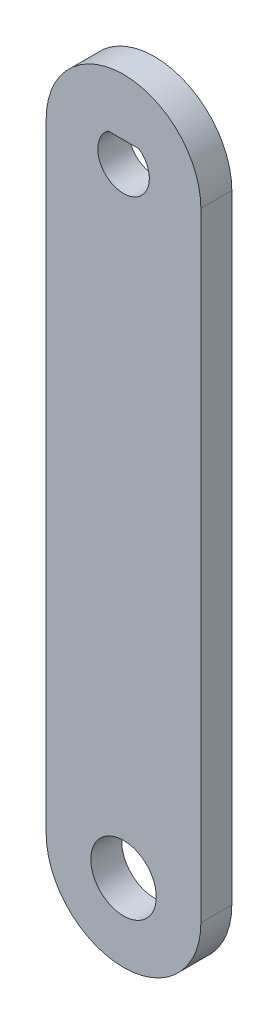
ISO-10303-21;
HEADER;
FILE_DESCRIPTION(('STEP AP214'),'2;1');
FILE_NAME('part.step','',(''),(''),'','','');
FILE_SCHEMA(('AUTOMOTIVE_DESIGN { 1 0 10303 214 1 1 1 1 }'));
ENDSEC;
DATA;
#1=APPLICATION_CONTEXT('core data for automotive mechanical design processes');
#2=APPLICATION_PROTOCOL_DEFINITION('international standard','automotive_design',2000,#1);
#3=PRODUCT_CONTEXT('',#1,'mechanical');
#4=PRODUCT('Part','Part','',(#3));
#5=PRODUCT_RELATED_PRODUCT_CATEGORY('part','',(#4));
#6=PRODUCT_DEFINITION_FORMATION('','',#4);
#7=PRODUCT_DEFINITION_CONTEXT('part definition',#1,'design');
#8=PRODUCT_DEFINITION('design','',#6,#7);
#9=PRODUCT_DEFINITION_SHAPE('','',#8);
#10=(LENGTH_UNIT() NAMED_UNIT(*) SI_UNIT(.MILLI.,.METRE.));
#11=(NAMED_UNIT(*) PLANE_ANGLE_UNIT() SI_UNIT($,.RADIAN.));
#12=(NAMED_UNIT(*) SI_UNIT($,.STERADIAN.) SOLID_ANGLE_UNIT());
#13=UNCERTAINTY_MEASURE_WITH_UNIT(LENGTH_MEASURE(1.E-05),#10,'distance_accuracy_value','');
#14=(GEOMETRIC_REPRESENTATION_CONTEXT(3) GLOBAL_UNCERTAINTY_ASSIGNED_CONTEXT((#13)) GLOBAL_UNIT_ASSIGNED_CONTEXT((#10,
#11,#12)) REPRESENTATION_CONTEXT('',''));
#15=CARTESIAN_POINT('',(0.,0.,0.));
#16=DIRECTION('',(0.,0.,1.));
#17=DIRECTION('',(1.,0.,0.));
#18=AXIS2_PLACEMENT_3D('',#15,#16,#17);
#19=CARTESIAN_POINT('',(0.,0.,-1.5));
#20=DIRECTION('',(0.,0.,1.));
#21=DIRECTION('',(1.,0.,0.));
#22=AXIS2_PLACEMENT_3D('',#19,#20,#21);
#23=CYLINDRICAL_SURFACE('',#22,7.5);
#24=DIRECTION('',(0.,0.,1.));
#25=VECTOR('',#24,1.);
#26=CARTESIAN_POINT('',(-7.5,0.,-1.5));
#27=LINE('',#26,#25);
#28=CARTESIAN_POINT('',(-7.5,0.,-1.5));
#29=VERTEX_POINT('',#28);
#30=CARTESIAN_POINT('',(-7.5,0.,1.5));
#31=VERTEX_POINT('',#30);
#32=EDGE_CURVE('E39',#29,#31,#27,.T.);
#33=ORIENTED_EDGE('',*,*,#32,.T.);
#34=CARTESIAN_POINT('',(0.,0.,1.5));
#35=DIRECTION('',(0.,0.,1.));
#36=DIRECTION('',(1.,0.,0.));
#37=AXIS2_PLACEMENT_3D('',#34,#35,#36);
#38=CIRCLE('',#37,7.5);
#39=CARTESIAN_POINT('',(7.5,0.,1.5));
#40=VERTEX_POINT('',#39);
#41=EDGE_CURVE('E102',#40,#31,#38,.T.);
#42=ORIENTED_EDGE('',*,*,#41,.F.);
#43=DIRECTION('',(0.,0.,1.));
#44=VECTOR('',#43,1.);
#45=CARTESIAN_POINT('',(7.5,0.,-1.5));
#46=LINE('',#45,#44);
#47=CARTESIAN_POINT('',(7.5,0.,-1.5));
#48=VERTEX_POINT('',#47);
#49=EDGE_CURVE('E11',#48,#40,#46,.T.);
#50=ORIENTED_EDGE('',*,*,#49,.F.);
#51=CARTESIAN_POINT('',(0.,0.,-1.5));
#52=DIRECTION('',(0.,0.,1.));
#53=DIRECTION('',(1.,0.,0.));
#54=AXIS2_PLACEMENT_3D('',#51,#52,#53);
#55=CIRCLE('',#54,7.5);
#56=EDGE_CURVE('E96',#48,#29,#55,.T.);
#57=ORIENTED_EDGE('',*,*,#56,.T.);
#58=EDGE_LOOP('',(#33,#42,#50,#57));
#59=FACE_BOUND('',#58,.T.);
#60=ADVANCED_FACE('F36',(#59),#23,.T.);
#61=CARTESIAN_POINT('',(7.5,0.,-1.5));
#62=DIRECTION('',(1.,0.,0.));
#63=DIRECTION('',(0.,1.,0.));
#64=AXIS2_PLACEMENT_3D('',#61,#62,#63);
#65=PLANE('',#64);
#66=ORIENTED_EDGE('',*,*,#49,.T.);
#67=DIRECTION('',(0.,1.,0.));
#68=VECTOR('',#67,1.);
#69=CARTESIAN_POINT('',(7.5,0.,1.5));
#70=LINE('',#69,#68);
#71=CARTESIAN_POINT('',(7.50000000000001,-60.,1.5));
#72=VERTEX_POINT('',#71);
#73=EDGE_CURVE('E119',#72,#40,#70,.T.);
#74=ORIENTED_EDGE('',*,*,#73,.F.);
#75=DIRECTION('',(0.,0.,1.));
#76=VECTOR('',#75,1.);
#77=CARTESIAN_POINT('',(7.50000000000001,-60.,-1.5));
#78=LINE('',#77,#76);
#79=CARTESIAN_POINT('',(7.50000000000001,-60.,-1.5));
#80=VERTEX_POINT('',#79);
#81=EDGE_CURVE('E44',#80,#72,#78,.T.);
#82=ORIENTED_EDGE('',*,*,#81,.F.);
#83=DIRECTION('',(0.,1.,0.));
#84=VECTOR('',#83,1.);
#85=CARTESIAN_POINT('',(7.5,0.,-1.5));
#86=LINE('',#85,#84);
#87=EDGE_CURVE('E136',#80,#48,#86,.T.);
#88=ORIENTED_EDGE('',*,*,#87,.T.);
#89=EDGE_LOOP('',(#66,#74,#82,#88));
#90=FACE_BOUND('',#89,.T.);
#91=ADVANCED_FACE('F148',(#90),#65,.T.);
#92=CARTESIAN_POINT('',(0.,-60.,-1.5));
#93=DIRECTION('',(0.,0.,1.));
#94=DIRECTION('',(1.,0.,0.));
#95=AXIS2_PLACEMENT_3D('',#92,#93,#94);
#96=CYLINDRICAL_SURFACE('',#95,7.5);
#97=ORIENTED_EDGE('',*,*,#81,.T.);
#98=CARTESIAN_POINT('',(0.,-60.,1.5));
#99=DIRECTION('',(0.,0.,1.));
#100=DIRECTION('',(1.,0.,0.));
#101=AXIS2_PLACEMENT_3D('',#98,#99,#100);
#102=CIRCLE('',#101,7.5);
#103=CARTESIAN_POINT('',(-7.49999999999999,-60.,1.5));
#104=VERTEX_POINT('',#103);
#105=EDGE_CURVE('E116',#104,#72,#102,.T.);
#106=ORIENTED_EDGE('',*,*,#105,.F.);
#107=DIRECTION('',(0.,0.,1.));
#108=VECTOR('',#107,1.);
#109=CARTESIAN_POINT('',(-7.49999999999999,-60.,-1.5));
#110=LINE('',#109,#108);
#111=CARTESIAN_POINT('',(-7.49999999999999,-60.,-1.5));
#112=VERTEX_POINT('',#111);
#113=EDGE_CURVE('E139',#112,#104,#110,.T.);
#114=ORIENTED_EDGE('',*,*,#113,.F.);
#115=CARTESIAN_POINT('',(0.,-60.,-1.5));
#116=DIRECTION('',(0.,0.,1.));
#117=DIRECTION('',(1.,0.,0.));
#118=AXIS2_PLACEMENT_3D('',#115,#116,#117);
#119=CIRCLE('',#118,7.5);
#120=EDGE_CURVE('E133',#112,#80,#119,.T.);
#121=ORIENTED_EDGE('',*,*,#120,.T.);
#122=EDGE_LOOP('',(#97,#106,#114,#121));
#123=FACE_BOUND('',#122,.T.);
#124=ADVANCED_FACE('F154',(#123),#96,.T.);
#125=CARTESIAN_POINT('',(-7.5,0.,-1.5));
#126=DIRECTION('',(-1.,0.,0.));
#127=DIRECTION('',(0.,-1.,0.));
#128=AXIS2_PLACEMENT_3D('',#125,#126,#127);
#129=PLANE('',#128);
#130=ORIENTED_EDGE('',*,*,#113,.T.);
#131=DIRECTION('',(0.,-1.,0.));
#132=VECTOR('',#131,1.);
#133=CARTESIAN_POINT('',(-7.5,0.,1.5));
#134=LINE('',#133,#132);
#135=EDGE_CURVE('E113',#31,#104,#134,.T.);
#136=ORIENTED_EDGE('',*,*,#135,.F.);
#137=ORIENTED_EDGE('',*,*,#32,.F.);
#138=DIRECTION('',(0.,-1.,0.));
#139=VECTOR('',#138,1.);
#140=CARTESIAN_POINT('',(-7.5,0.,-1.5));
#141=LINE('',#140,#139);
#142=EDGE_CURVE('E130',#29,#112,#141,.T.);
#143=ORIENTED_EDGE('',*,*,#142,.T.);
#144=EDGE_LOOP('',(#130,#136,#137,#143));
#145=FACE_BOUND('',#144,.T.);
#146=ADVANCED_FACE('F143',(#145),#129,.T.);
#147=CARTESIAN_POINT('',(0.,0.,-1.5));
#148=DIRECTION('',(0.,0.,1.));
#149=DIRECTION('',(1.,0.,0.));
#150=AXIS2_PLACEMENT_3D('',#147,#148,#149);
#151=PLANE('',#150);
#152=CARTESIAN_POINT('',(0.,-60.,-1.5));
#153=DIRECTION('',(0.,0.,1.));
#154=DIRECTION('',(1.,0.,0.));
#155=AXIS2_PLACEMENT_3D('',#152,#153,#154);
#156=CIRCLE('',#155,3.175);
#157=CARTESIAN_POINT('',(3.17500000000001,-60.,-1.5));
#158=VERTEX_POINT('',#157);
#159=EDGE_CURVE('E122',#158,#158,#156,.T.);
#160=ORIENTED_EDGE('',*,*,#159,.T.);
#161=EDGE_LOOP('',(#160));
#162=FACE_BOUND('',#161,.T.);
#163=DIRECTION('',(-1.,0.,0.));
#164=VECTOR('',#163,1.);
#165=CARTESIAN_POINT('',(-1.5,2.,-1.5));
#166=LINE('',#165,#164);
#167=CARTESIAN_POINT('',(1.5,2.,-1.5));
#168=VERTEX_POINT('',#167);
#169=CARTESIAN_POINT('',(-1.5,2.,-1.5));
#170=VERTEX_POINT('',#169);
#171=EDGE_CURVE('E126',#168,#170,#166,.T.);
#172=ORIENTED_EDGE('',*,*,#171,.T.);
#173=CARTESIAN_POINT('',(0.,0.,-1.5));
#174=DIRECTION('',(0.,0.,1.));
#175=DIRECTION('',(1.,0.,0.));
#176=AXIS2_PLACEMENT_3D('',#173,#174,#175);
#177=CIRCLE('',#176,2.50000000000001);
#178=EDGE_CURVE('E52',#170,#168,#177,.T.);
#179=ORIENTED_EDGE('',*,*,#178,.T.);
#180=EDGE_LOOP('',(#172,#179));
#181=FACE_BOUND('',#180,.T.);
#182=ORIENTED_EDGE('',*,*,#56,.F.);
#183=ORIENTED_EDGE('',*,*,#87,.F.);
#184=ORIENTED_EDGE('',*,*,#120,.F.);
#185=ORIENTED_EDGE('',*,*,#142,.F.);
#186=EDGE_LOOP('',(#182,#183,#184,#185));
#187=FACE_BOUND('',#186,.T.);
#188=ADVANCED_FACE('F152',(#162,#181,#187),#151,.F.);
#189=CARTESIAN_POINT('',(0.,0.,-1.5));
#190=DIRECTION('',(0.,0.,1.));
#191=DIRECTION('',(1.,0.,0.));
#192=AXIS2_PLACEMENT_3D('',#189,#190,#191);
#193=CYLINDRICAL_SURFACE('',#192,2.50000000000001);
#194=DIRECTION('',(0.,0.,1.));
#195=VECTOR('',#194,1.);
#196=CARTESIAN_POINT('',(-1.5,2.,-1.5));
#197=LINE('',#196,#195);
#198=CARTESIAN_POINT('',(-1.5,2.,1.5));
#199=VERTEX_POINT('',#198);
#200=EDGE_CURVE('E87',#170,#199,#197,.T.);
#201=ORIENTED_EDGE('',*,*,#200,.T.);
#202=CARTESIAN_POINT('',(0.,0.,1.5));
#203=DIRECTION('',(0.,0.,1.));
#204=DIRECTION('',(1.,0.,0.));
#205=AXIS2_PLACEMENT_3D('',#202,#203,#204);
#206=CIRCLE('',#205,2.50000000000001);
#207=CARTESIAN_POINT('',(1.5,2.,1.5));
#208=VERTEX_POINT('',#207);
#209=EDGE_CURVE('E91',#199,#208,#206,.T.);
#210=ORIENTED_EDGE('',*,*,#209,.T.);
#211=DIRECTION('',(0.,0.,1.));
#212=VECTOR('',#211,1.);
#213=CARTESIAN_POINT('',(1.5,2.,-1.5));
#214=LINE('',#213,#212);
#215=EDGE_CURVE('E97',#168,#208,#214,.T.);
#216=ORIENTED_EDGE('',*,*,#215,.F.);
#217=ORIENTED_EDGE('',*,*,#178,.F.);
#218=EDGE_LOOP('',(#201,#210,#216,#217));
#219=FACE_BOUND('',#218,.T.);
#220=ADVANCED_FACE('F89',(#219),#193,.F.);
#221=CARTESIAN_POINT('',(-1.5,2.,-1.5));
#222=DIRECTION('',(0.,1.,0.));
#223=DIRECTION('',(-1.,0.,0.));
#224=AXIS2_PLACEMENT_3D('',#221,#222,#223);
#225=PLANE('',#224);
#226=ORIENTED_EDGE('',*,*,#215,.T.);
#227=DIRECTION('',(-1.,0.,0.));
#228=VECTOR('',#227,1.);
#229=CARTESIAN_POINT('',(-1.5,2.,1.5));
#230=LINE('',#229,#228);
#231=EDGE_CURVE('E99',#208,#199,#230,.T.);
#232=ORIENTED_EDGE('',*,*,#231,.T.);
#233=ORIENTED_EDGE('',*,*,#200,.F.);
#234=ORIENTED_EDGE('',*,*,#171,.F.);
#235=EDGE_LOOP('',(#226,#232,#233,#234));
#236=FACE_BOUND('',#235,.T.);
#237=ADVANCED_FACE('F100',(#236),#225,.F.);
#238=CARTESIAN_POINT('',(0.,-60.,-1.5));
#239=DIRECTION('',(0.,0.,1.));
#240=DIRECTION('',(1.,0.,0.));
#241=AXIS2_PLACEMENT_3D('',#238,#239,#240);
#242=CYLINDRICAL_SURFACE('',#241,3.175);
#243=ORIENTED_EDGE('',*,*,#159,.F.);
#244=EDGE_LOOP('',(#243));
#245=FACE_BOUND('',#244,.T.);
#246=CARTESIAN_POINT('',(0.,-60.,1.5));
#247=DIRECTION('',(0.,0.,1.));
#248=DIRECTION('',(1.,0.,0.));
#249=AXIS2_PLACEMENT_3D('',#246,#247,#248);
#250=CIRCLE('',#249,3.175);
#251=CARTESIAN_POINT('',(3.17500000000001,-60.,1.5));
#252=VERTEX_POINT('',#251);
#253=EDGE_CURVE('E106',#252,#252,#250,.T.);
#254=ORIENTED_EDGE('',*,*,#253,.T.);
#255=EDGE_LOOP('',(#254));
#256=FACE_BOUND('',#255,.T.);
#257=ADVANCED_FACE('F205',(#245,#256),#242,.F.);
#258=CARTESIAN_POINT('',(0.,0.,1.5));
#259=DIRECTION('',(0.,0.,1.));
#260=DIRECTION('',(1.,0.,0.));
#261=AXIS2_PLACEMENT_3D('',#258,#259,#260);
#262=PLANE('',#261);
#263=ORIENTED_EDGE('',*,*,#231,.F.);
#264=ORIENTED_EDGE('',*,*,#209,.F.);
#265=EDGE_LOOP('',(#263,#264));
#266=FACE_BOUND('',#265,.T.);
#267=ORIENTED_EDGE('',*,*,#41,.T.);
#268=ORIENTED_EDGE('',*,*,#135,.T.);
#269=ORIENTED_EDGE('',*,*,#105,.T.);
#270=ORIENTED_EDGE('',*,*,#73,.T.);
#271=EDGE_LOOP('',(#267,#268,#269,#270));
#272=FACE_BOUND('',#271,.T.);
#273=ORIENTED_EDGE('',*,*,#253,.F.);
#274=EDGE_LOOP('',(#273));
#275=FACE_BOUND('',#274,.T.);
#276=ADVANCED_FACE('F104',(#266,#272,#275),#262,.T.);
#277=CLOSED_SHELL('',(#60,#91,#124,#146,#188,#220,#237,#257,#276));
#278=MANIFOLD_SOLID_BREP('B2',#277);
#279=ADVANCED_BREP_SHAPE_REPRESENTATION('',(#18,#278),#14);
#280=SHAPE_DEFINITION_REPRESENTATION(#9,#279);
ENDSEC;
END-ISO-10303-21;
